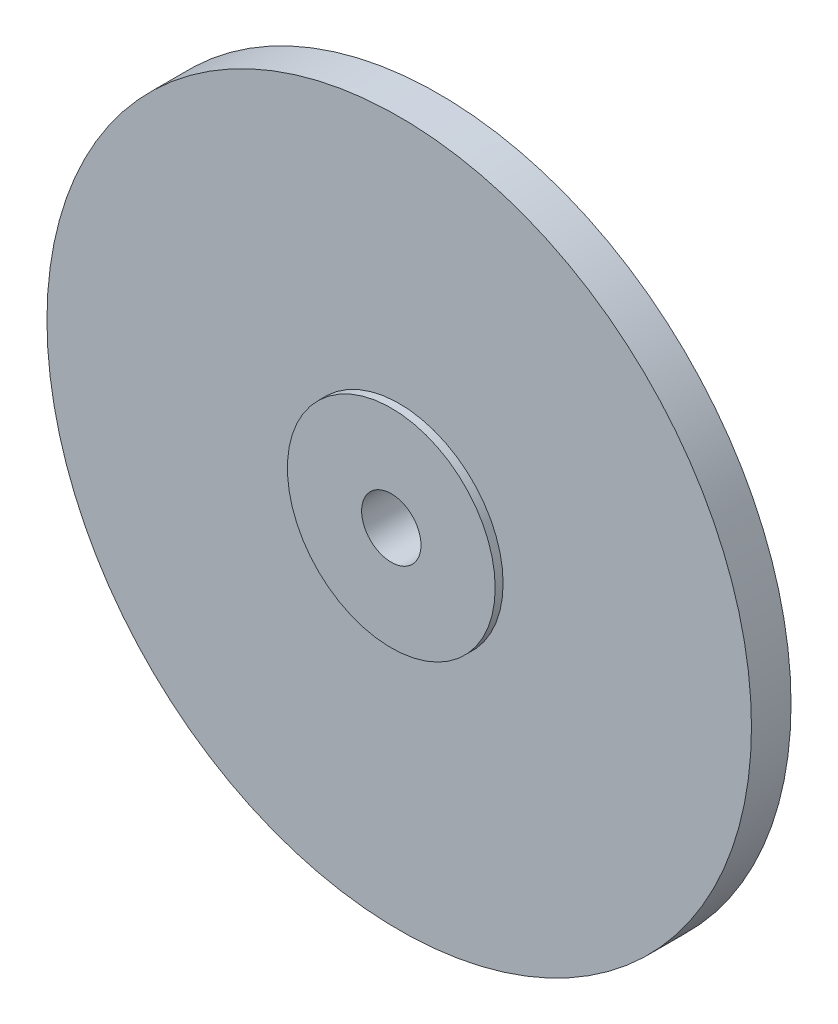
ISO-10303-21;
HEADER;
FILE_DESCRIPTION(('STEP AP214'),'2;1');
FILE_NAME('part.step','',(''),(''),'','','');
FILE_SCHEMA(('AUTOMOTIVE_DESIGN { 1 0 10303 214 1 1 1 1 }'));
ENDSEC;
DATA;
#1=APPLICATION_CONTEXT('core data for automotive mechanical design processes');
#2=APPLICATION_PROTOCOL_DEFINITION('international standard','automotive_design',2000,#1);
#3=PRODUCT_CONTEXT('',#1,'mechanical');
#4=PRODUCT('Part','Part','',(#3));
#5=PRODUCT_RELATED_PRODUCT_CATEGORY('part','',(#4));
#6=PRODUCT_DEFINITION_FORMATION('','',#4);
#7=PRODUCT_DEFINITION_CONTEXT('part definition',#1,'design');
#8=PRODUCT_DEFINITION('design','',#6,#7);
#9=PRODUCT_DEFINITION_SHAPE('','',#8);
#10=(LENGTH_UNIT() NAMED_UNIT(*) SI_UNIT(.MILLI.,.METRE.));
#11=(NAMED_UNIT(*) PLANE_ANGLE_UNIT() SI_UNIT($,.RADIAN.));
#12=(NAMED_UNIT(*) SI_UNIT($,.STERADIAN.) SOLID_ANGLE_UNIT());
#13=UNCERTAINTY_MEASURE_WITH_UNIT(LENGTH_MEASURE(1.E-05),#10,'distance_accuracy_value','');
#14=(GEOMETRIC_REPRESENTATION_CONTEXT(3) GLOBAL_UNCERTAINTY_ASSIGNED_CONTEXT((#13)) GLOBAL_UNIT_ASSIGNED_CONTEXT((#10,
#11,#12)) REPRESENTATION_CONTEXT('',''));
#15=CARTESIAN_POINT('',(0.,0.,0.));
#16=DIRECTION('',(0.,0.,1.));
#17=DIRECTION('',(1.,0.,0.));
#18=AXIS2_PLACEMENT_3D('',#15,#16,#17);
#19=CARTESIAN_POINT('',(0.,0.,2.));
#20=DIRECTION('',(0.,0.,-1.));
#21=DIRECTION('',(-1.,0.,0.));
#22=AXIS2_PLACEMENT_3D('',#19,#20,#21);
#23=CYLINDRICAL_SURFACE('',#22,17.8);
#24=CARTESIAN_POINT('',(0.,0.,2.));
#25=DIRECTION('',(0.,0.,1.));
#26=DIRECTION('',(1.,0.,0.));
#27=AXIS2_PLACEMENT_3D('',#24,#25,#26);
#28=CIRCLE('',#27,17.8);
#29=CARTESIAN_POINT('',(17.8,0.,2.));
#30=VERTEX_POINT('',#29);
#31=EDGE_CURVE('E56',#30,#30,#28,.T.);
#32=ORIENTED_EDGE('',*,*,#31,.F.);
#33=EDGE_LOOP('',(#32));
#34=FACE_BOUND('',#33,.T.);
#35=CARTESIAN_POINT('',(0.,0.,0.));
#36=DIRECTION('',(0.,0.,1.));
#37=DIRECTION('',(1.,0.,0.));
#38=AXIS2_PLACEMENT_3D('',#35,#36,#37);
#39=CIRCLE('',#38,17.8);
#40=CARTESIAN_POINT('',(17.8,0.,0.));
#41=VERTEX_POINT('',#40);
#42=EDGE_CURVE('E55',#41,#41,#39,.T.);
#43=ORIENTED_EDGE('',*,*,#42,.T.);
#44=EDGE_LOOP('',(#43));
#45=FACE_BOUND('',#44,.T.);
#46=ADVANCED_FACE('F31',(#34,#45),#23,.T.);
#47=CARTESIAN_POINT('',(0.,0.,2.));
#48=DIRECTION('',(0.,0.,1.));
#49=DIRECTION('',(1.,0.,0.));
#50=AXIS2_PLACEMENT_3D('',#47,#48,#49);
#51=PLANE('',#50);
#52=CARTESIAN_POINT('',(0.,0.,2.));
#53=DIRECTION('',(0.,0.,1.));
#54=DIRECTION('',(1.,0.,0.));
#55=AXIS2_PLACEMENT_3D('',#52,#53,#54);
#56=CIRCLE('',#55,5.25);
#57=CARTESIAN_POINT('',(5.25,0.,2.));
#58=VERTEX_POINT('',#57);
#59=EDGE_CURVE('E10',#58,#58,#56,.T.);
#60=ORIENTED_EDGE('',*,*,#59,.F.);
#61=EDGE_LOOP('',(#60));
#62=FACE_BOUND('',#61,.T.);
#63=ORIENTED_EDGE('',*,*,#31,.T.);
#64=EDGE_LOOP('',(#63));
#65=FACE_BOUND('',#64,.T.);
#66=ADVANCED_FACE('F64',(#62,#65),#51,.T.);
#67=CARTESIAN_POINT('',(0.,0.,0.));
#68=DIRECTION('',(0.,0.,1.));
#69=DIRECTION('',(1.,0.,0.));
#70=AXIS2_PLACEMENT_3D('',#67,#68,#69);
#71=PLANE('',#70);
#72=CARTESIAN_POINT('',(0.,0.,0.));
#73=DIRECTION('',(0.,0.,1.));
#74=DIRECTION('',(1.,0.,0.));
#75=AXIS2_PLACEMENT_3D('',#72,#73,#74);
#76=CIRCLE('',#75,7.86396405194257);
#77=CARTESIAN_POINT('',(7.86396405194257,0.,0.));
#78=VERTEX_POINT('',#77);
#79=EDGE_CURVE('E35',#78,#78,#76,.F.);
#80=ORIENTED_EDGE('',*,*,#79,.F.);
#81=EDGE_LOOP('',(#80));
#82=FACE_BOUND('',#81,.T.);
#83=ORIENTED_EDGE('',*,*,#42,.F.);
#84=EDGE_LOOP('',(#83));
#85=FACE_BOUND('',#84,.T.);
#86=ADVANCED_FACE('F62',(#82,#85),#71,.F.);
#87=CARTESIAN_POINT('',(0.,0.,-0.8));
#88=DIRECTION('',(0.,0.,1.));
#89=DIRECTION('',(-1.,0.,0.));
#90=AXIS2_PLACEMENT_3D('',#87,#88,#89);
#91=CONICAL_SURFACE('',#90,7.85,0.0174532925199433);
#92=CARTESIAN_POINT('',(0.,0.,-0.8));
#93=DIRECTION('',(0.,0.,-1.));
#94=DIRECTION('',(-1.,0.,0.));
#95=AXIS2_PLACEMENT_3D('',#92,#93,#94);
#96=CIRCLE('',#95,7.85);
#97=CARTESIAN_POINT('',(-7.85,0.,-0.8));
#98=VERTEX_POINT('',#97);
#99=EDGE_CURVE('E51',#98,#98,#96,.T.);
#100=ORIENTED_EDGE('',*,*,#99,.F.);
#101=EDGE_LOOP('',(#100));
#102=FACE_BOUND('',#101,.T.);
#103=ORIENTED_EDGE('',*,*,#79,.T.);
#104=EDGE_LOOP('',(#103));
#105=FACE_BOUND('',#104,.T.);
#106=ADVANCED_FACE('F33',(#102,#105),#91,.T.);
#107=CARTESIAN_POINT('',(0.,0.,-0.8));
#108=DIRECTION('',(0.,0.,-1.));
#109=DIRECTION('',(-1.,0.,0.));
#110=AXIS2_PLACEMENT_3D('',#107,#108,#109);
#111=PLANE('',#110);
#112=CARTESIAN_POINT('',(0.,0.,-0.8));
#113=DIRECTION('',(0.,0.,-1.));
#114=DIRECTION('',(-1.,0.,0.));
#115=AXIS2_PLACEMENT_3D('',#112,#113,#114);
#116=CIRCLE('',#115,4.8);
#117=CARTESIAN_POINT('',(-4.8,0.,-0.8));
#118=VERTEX_POINT('',#117);
#119=EDGE_CURVE('E39',#118,#118,#116,.T.);
#120=ORIENTED_EDGE('',*,*,#119,.F.);
#121=EDGE_LOOP('',(#120));
#122=FACE_BOUND('',#121,.T.);
#123=ORIENTED_EDGE('',*,*,#99,.T.);
#124=EDGE_LOOP('',(#123));
#125=FACE_BOUND('',#124,.T.);
#126=ADVANCED_FACE('F71',(#122,#125),#111,.T.);
#127=CARTESIAN_POINT('',(0.,0.,-2.7));
#128=DIRECTION('',(0.,0.,1.));
#129=DIRECTION('',(1.,0.,0.));
#130=AXIS2_PLACEMENT_3D('',#127,#128,#129);
#131=CYLINDRICAL_SURFACE('',#130,4.8);
#132=CARTESIAN_POINT('',(0.,0.,-2.7));
#133=DIRECTION('',(0.,0.,-1.));
#134=DIRECTION('',(-1.,0.,0.));
#135=AXIS2_PLACEMENT_3D('',#132,#133,#134);
#136=CIRCLE('',#135,4.8);
#137=CARTESIAN_POINT('',(-4.8,0.,-2.7));
#138=VERTEX_POINT('',#137);
#139=EDGE_CURVE('E49',#138,#138,#136,.T.);
#140=ORIENTED_EDGE('',*,*,#139,.F.);
#141=EDGE_LOOP('',(#140));
#142=FACE_BOUND('',#141,.T.);
#143=ORIENTED_EDGE('',*,*,#119,.T.);
#144=EDGE_LOOP('',(#143));
#145=FACE_BOUND('',#144,.T.);
#146=ADVANCED_FACE('F93',(#142,#145),#131,.T.);
#147=CARTESIAN_POINT('',(0.,0.,-2.7));
#148=DIRECTION('',(0.,0.,-1.));
#149=DIRECTION('',(-1.,0.,0.));
#150=AXIS2_PLACEMENT_3D('',#147,#148,#149);
#151=PLANE('',#150);
#152=CARTESIAN_POINT('',(0.,0.,-2.7));
#153=DIRECTION('',(0.,0.,-1.));
#154=DIRECTION('',(-1.,0.,0.));
#155=AXIS2_PLACEMENT_3D('',#152,#153,#154);
#156=CIRCLE('',#155,1.5);
#157=CARTESIAN_POINT('',(-1.5,0.,-2.7));
#158=VERTEX_POINT('',#157);
#159=EDGE_CURVE('E170',#158,#158,#156,.T.);
#160=ORIENTED_EDGE('',*,*,#159,.F.);
#161=EDGE_LOOP('',(#160));
#162=FACE_BOUND('',#161,.T.);
#163=ORIENTED_EDGE('',*,*,#139,.T.);
#164=EDGE_LOOP('',(#163));
#165=FACE_BOUND('',#164,.T.);
#166=ADVANCED_FACE('F104',(#162,#165),#151,.T.);
#167=CARTESIAN_POINT('',(0.,0.,2.4));
#168=DIRECTION('',(0.,0.,-1.));
#169=DIRECTION('',(-1.,0.,0.));
#170=AXIS2_PLACEMENT_3D('',#167,#168,#169);
#171=CYLINDRICAL_SURFACE('',#170,5.25);
#172=CARTESIAN_POINT('',(0.,0.,2.4));
#173=DIRECTION('',(0.,0.,1.));
#174=DIRECTION('',(1.,0.,0.));
#175=AXIS2_PLACEMENT_3D('',#172,#173,#174);
#176=CIRCLE('',#175,5.25);
#177=CARTESIAN_POINT('',(5.25,0.,2.4));
#178=VERTEX_POINT('',#177);
#179=EDGE_CURVE('E47',#178,#178,#176,.T.);
#180=ORIENTED_EDGE('',*,*,#179,.F.);
#181=EDGE_LOOP('',(#180));
#182=FACE_BOUND('',#181,.T.);
#183=ORIENTED_EDGE('',*,*,#59,.T.);
#184=EDGE_LOOP('',(#183));
#185=FACE_BOUND('',#184,.T.);
#186=ADVANCED_FACE('F98',(#182,#185),#171,.T.);
#187=CARTESIAN_POINT('',(0.,0.,2.4));
#188=DIRECTION('',(0.,0.,1.));
#189=DIRECTION('',(1.,0.,0.));
#190=AXIS2_PLACEMENT_3D('',#187,#188,#189);
#191=PLANE('',#190);
#192=CARTESIAN_POINT('',(0.,0.,2.4));
#193=DIRECTION('',(0.,0.,1.));
#194=DIRECTION('',(1.,0.,0.));
#195=AXIS2_PLACEMENT_3D('',#192,#193,#194);
#196=CIRCLE('',#195,1.5);
#197=CARTESIAN_POINT('',(1.5,0.,2.4));
#198=VERTEX_POINT('',#197);
#199=EDGE_CURVE('E173',#198,#198,#196,.T.);
#200=ORIENTED_EDGE('',*,*,#199,.F.);
#201=EDGE_LOOP('',(#200));
#202=FACE_BOUND('',#201,.T.);
#203=ORIENTED_EDGE('',*,*,#179,.T.);
#204=EDGE_LOOP('',(#203));
#205=FACE_BOUND('',#204,.T.);
#206=ADVANCED_FACE('F103',(#202,#205),#191,.T.);
#207=CARTESIAN_POINT('',(0.,0.,-8.));
#208=DIRECTION('',(0.,0.,1.));
#209=DIRECTION('',(1.,0.,0.));
#210=AXIS2_PLACEMENT_3D('',#207,#208,#209);
#211=CYLINDRICAL_SURFACE('',#210,1.5);
#212=ORIENTED_EDGE('',*,*,#159,.T.);
#213=EDGE_LOOP('',(#212));
#214=FACE_BOUND('',#213,.T.);
#215=ORIENTED_EDGE('',*,*,#199,.T.);
#216=EDGE_LOOP('',(#215));
#217=FACE_BOUND('',#216,.T.);
#218=ADVANCED_FACE('F123',(#214,#217),#211,.F.);
#219=CLOSED_SHELL('',(#46,#66,#86,#106,#126,#146,#166,#186,#206,#218));
#220=MANIFOLD_SOLID_BREP('B2',#219);
#221=ADVANCED_BREP_SHAPE_REPRESENTATION('',(#18,#220),#14);
#222=SHAPE_DEFINITION_REPRESENTATION(#9,#221);
ENDSEC;
END-ISO-10303-21;
